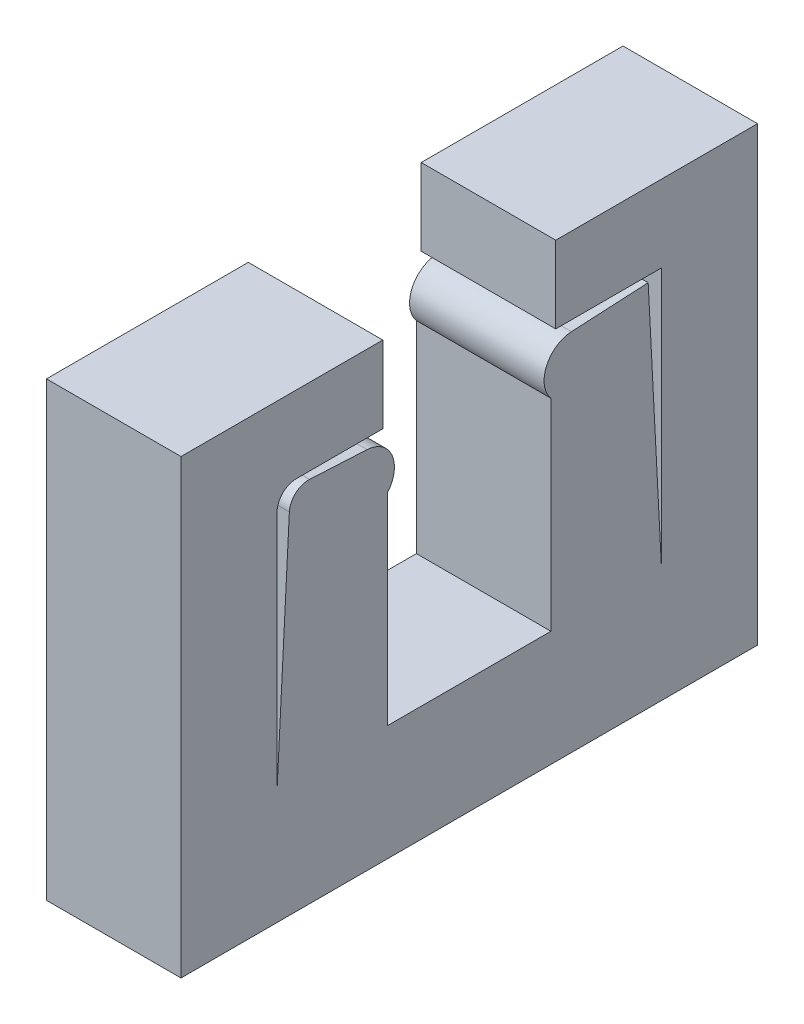
ISO-10303-21;
HEADER;
FILE_DESCRIPTION(('STEP AP214'),'2;1');
FILE_NAME('part.step','',(''),(''),'','','');
FILE_SCHEMA(('AUTOMOTIVE_DESIGN { 1 0 10303 214 1 1 1 1 }'));
ENDSEC;
DATA;
#1=APPLICATION_CONTEXT('core data for automotive mechanical design processes');
#2=APPLICATION_PROTOCOL_DEFINITION('international standard','automotive_design',2000,#1);
#3=PRODUCT_CONTEXT('',#1,'mechanical');
#4=PRODUCT('Part','Part','',(#3));
#5=PRODUCT_RELATED_PRODUCT_CATEGORY('part','',(#4));
#6=PRODUCT_DEFINITION_FORMATION('','',#4);
#7=PRODUCT_DEFINITION_CONTEXT('part definition',#1,'design');
#8=PRODUCT_DEFINITION('design','',#6,#7);
#9=PRODUCT_DEFINITION_SHAPE('','',#8);
#10=(LENGTH_UNIT() NAMED_UNIT(*) SI_UNIT(.MILLI.,.METRE.));
#11=(NAMED_UNIT(*) PLANE_ANGLE_UNIT() SI_UNIT($,.RADIAN.));
#12=(NAMED_UNIT(*) SI_UNIT($,.STERADIAN.) SOLID_ANGLE_UNIT());
#13=UNCERTAINTY_MEASURE_WITH_UNIT(LENGTH_MEASURE(1.E-05),#10,'distance_accuracy_value','');
#14=(GEOMETRIC_REPRESENTATION_CONTEXT(3) GLOBAL_UNCERTAINTY_ASSIGNED_CONTEXT((#13)) GLOBAL_UNIT_ASSIGNED_CONTEXT((#10,
#11,#12)) REPRESENTATION_CONTEXT('',''));
#15=CARTESIAN_POINT('',(0.,0.,0.));
#16=DIRECTION('',(0.,0.,1.));
#17=DIRECTION('',(1.,0.,0.));
#18=AXIS2_PLACEMENT_3D('',#15,#16,#17);
#19=CARTESIAN_POINT('',(7.,49.2713297407778,87.5368565318083));
#20=DIRECTION('',(0.,-1.,0.));
#21=DIRECTION('',(0.,0.,-1.));
#22=AXIS2_PLACEMENT_3D('',#19,#20,#21);
#23=PLANE('',#22);
#24=DIRECTION('',(0.,0.,1.));
#25=VECTOR('',#24,1.);
#26=CARTESIAN_POINT('',(0.,49.2713297407778,87.5368565318083));
#27=LINE('',#26,#25);
#28=CARTESIAN_POINT('',(0.,49.2713297407778,77.0368565318083));
#29=VERTEX_POINT('',#28);
#30=CARTESIAN_POINT('',(0.,49.2713297407778,87.5368565318083));
#31=VERTEX_POINT('',#30);
#32=EDGE_CURVE('E193',#29,#31,#27,.T.);
#33=ORIENTED_EDGE('',*,*,#32,.T.);
#34=DIRECTION('',(-1.,0.,0.));
#35=VECTOR('',#34,1.);
#36=CARTESIAN_POINT('',(7.,49.2713297407778,87.5368565318083));
#37=LINE('',#36,#35);
#38=CARTESIAN_POINT('',(7.,49.2713297407778,87.5368565318083));
#39=VERTEX_POINT('',#38);
#40=EDGE_CURVE('E337',#39,#31,#37,.T.);
#41=ORIENTED_EDGE('',*,*,#40,.F.);
#42=DIRECTION('',(0.,0.,1.));
#43=VECTOR('',#42,1.);
#44=CARTESIAN_POINT('',(7.,49.2713297407778,87.5368565318083));
#45=LINE('',#44,#43);
#46=CARTESIAN_POINT('',(7.,49.2713297407778,77.0368565318083));
#47=VERTEX_POINT('',#46);
#48=EDGE_CURVE('E270',#47,#39,#45,.T.);
#49=ORIENTED_EDGE('',*,*,#48,.F.);
#50=DIRECTION('',(-1.,0.,0.));
#51=VECTOR('',#50,1.);
#52=CARTESIAN_POINT('',(7.,49.2713297407778,77.0368565318083));
#53=LINE('',#52,#51);
#54=EDGE_CURVE('E294',#47,#29,#53,.T.);
#55=ORIENTED_EDGE('',*,*,#54,.T.);
#56=EDGE_LOOP('',(#33,#41,#49,#55));
#57=FACE_BOUND('',#56,.T.);
#58=ADVANCED_FACE('F33',(#57),#23,.F.);
#59=CARTESIAN_POINT('',(7.,49.2713297407778,87.5368565318083));
#60=DIRECTION('',(0.,0.,-1.));
#61=DIRECTION('',(-1.,0.,0.));
#62=AXIS2_PLACEMENT_3D('',#59,#60,#61);
#63=PLANE('',#62);
#64=DIRECTION('',(0.,-1.,0.));
#65=VECTOR('',#64,1.);
#66=CARTESIAN_POINT('',(0.,49.2713297407778,87.5368565318083));
#67=LINE('',#66,#65);
#68=CARTESIAN_POINT('',(0.,25.7713297407778,87.5368565318083));
#69=VERTEX_POINT('',#68);
#70=EDGE_CURVE('E297',#31,#69,#67,.T.);
#71=ORIENTED_EDGE('',*,*,#70,.T.);
#72=DIRECTION('',(-1.,0.,0.));
#73=VECTOR('',#72,1.);
#74=CARTESIAN_POINT('',(7.,25.7713297407778,87.5368565318083));
#75=LINE('',#74,#73);
#76=CARTESIAN_POINT('',(7.,25.7713297407778,87.5368565318083));
#77=VERTEX_POINT('',#76);
#78=EDGE_CURVE('E334',#77,#69,#75,.T.);
#79=ORIENTED_EDGE('',*,*,#78,.F.);
#80=DIRECTION('',(0.,-1.,0.));
#81=VECTOR('',#80,1.);
#82=CARTESIAN_POINT('',(7.,49.2713297407778,87.5368565318083));
#83=LINE('',#82,#81);
#84=EDGE_CURVE('E273',#39,#77,#83,.T.);
#85=ORIENTED_EDGE('',*,*,#84,.F.);
#86=ORIENTED_EDGE('',*,*,#40,.T.);
#87=EDGE_LOOP('',(#71,#79,#85,#86));
#88=FACE_BOUND('',#87,.T.);
#89=ADVANCED_FACE('F380',(#88),#63,.F.);
#90=CARTESIAN_POINT('',(7.,25.7713297407778,87.5368565318083));
#91=DIRECTION('',(0.,1.,0.));
#92=DIRECTION('',(0.,0.,1.));
#93=AXIS2_PLACEMENT_3D('',#90,#91,#92);
#94=PLANE('',#93);
#95=DIRECTION('',(0.,0.,-1.));
#96=VECTOR('',#95,1.);
#97=CARTESIAN_POINT('',(0.,25.7713297407778,87.5368565318083));
#98=LINE('',#97,#96);
#99=CARTESIAN_POINT('',(0.,25.7713297407778,57.5368565318083));
#100=VERTEX_POINT('',#99);
#101=EDGE_CURVE('E299',#69,#100,#98,.T.);
#102=ORIENTED_EDGE('',*,*,#101,.T.);
#103=DIRECTION('',(-1.,0.,0.));
#104=VECTOR('',#103,1.);
#105=CARTESIAN_POINT('',(7.,25.7713297407778,57.5368565318083));
#106=LINE('',#105,#104);
#107=CARTESIAN_POINT('',(7.,25.7713297407778,57.5368565318083));
#108=VERTEX_POINT('',#107);
#109=EDGE_CURVE('E253',#108,#100,#106,.T.);
#110=ORIENTED_EDGE('',*,*,#109,.F.);
#111=DIRECTION('',(0.,0.,-1.));
#112=VECTOR('',#111,1.);
#113=CARTESIAN_POINT('',(7.,25.7713297407778,87.5368565318083));
#114=LINE('',#113,#112);
#115=EDGE_CURVE('E276',#77,#108,#114,.T.);
#116=ORIENTED_EDGE('',*,*,#115,.F.);
#117=ORIENTED_EDGE('',*,*,#78,.T.);
#118=EDGE_LOOP('',(#102,#110,#116,#117));
#119=FACE_BOUND('',#118,.T.);
#120=ADVANCED_FACE('F385',(#119),#94,.F.);
#121=CARTESIAN_POINT('',(7.,31.7713297407778,76.7868565318083));
#122=DIRECTION('',(0.,-1.,0.));
#123=DIRECTION('',(0.,0.,-1.));
#124=AXIS2_PLACEMENT_3D('',#121,#122,#123);
#125=PLANE('',#124);
#126=DIRECTION('',(0.,0.,1.));
#127=VECTOR('',#126,1.);
#128=CARTESIAN_POINT('',(0.,31.7713297407778,76.7868565318083));
#129=LINE('',#128,#127);
#130=CARTESIAN_POINT('',(0.,31.7713297407778,68.2868565318083));
#131=VERTEX_POINT('',#130);
#132=CARTESIAN_POINT('',(0.,31.7713297407778,76.7868565318083));
#133=VERTEX_POINT('',#132);
#134=EDGE_CURVE('E301',#131,#133,#129,.T.);
#135=ORIENTED_EDGE('',*,*,#134,.T.);
#136=DIRECTION('',(-1.,0.,0.));
#137=VECTOR('',#136,1.);
#138=CARTESIAN_POINT('',(7.,31.7713297407778,76.7868565318083));
#139=LINE('',#138,#137);
#140=CARTESIAN_POINT('',(7.,31.7713297407778,76.7868565318083));
#141=VERTEX_POINT('',#140);
#142=EDGE_CURVE('E331',#141,#133,#139,.T.);
#143=ORIENTED_EDGE('',*,*,#142,.F.);
#144=DIRECTION('',(0.,0.,1.));
#145=VECTOR('',#144,1.);
#146=CARTESIAN_POINT('',(7.,31.7713297407778,76.7868565318083));
#147=LINE('',#146,#145);
#148=CARTESIAN_POINT('',(7.,31.7713297407778,68.2868565318083));
#149=VERTEX_POINT('',#148);
#150=EDGE_CURVE('E278',#149,#141,#147,.T.);
#151=ORIENTED_EDGE('',*,*,#150,.F.);
#152=DIRECTION('',(-1.,0.,0.));
#153=VECTOR('',#152,1.);
#154=CARTESIAN_POINT('',(7.,31.7713297407778,68.2868565318083));
#155=LINE('',#154,#153);
#156=EDGE_CURVE('E256',#149,#131,#155,.T.);
#157=ORIENTED_EDGE('',*,*,#156,.T.);
#158=EDGE_LOOP('',(#135,#143,#151,#157));
#159=FACE_BOUND('',#158,.T.);
#160=ADVANCED_FACE('F391',(#159),#125,.F.);
#161=CARTESIAN_POINT('',(7.,42.2713297407778,76.7868565318083));
#162=DIRECTION('',(0.,0.,1.));
#163=DIRECTION('',(0.,-1.,0.));
#164=AXIS2_PLACEMENT_3D('',#161,#162,#163);
#165=PLANE('',#164);
#166=DIRECTION('',(0.,1.,0.));
#167=VECTOR('',#166,1.);
#168=CARTESIAN_POINT('',(0.,42.2713297407778,76.7868565318083));
#169=LINE('',#168,#167);
#170=CARTESIAN_POINT('',(0.,42.2713297407778,76.7868565318083));
#171=VERTEX_POINT('',#170);
#172=EDGE_CURVE('E303',#133,#171,#169,.T.);
#173=ORIENTED_EDGE('',*,*,#172,.T.);
#174=DIRECTION('',(-1.,0.,0.));
#175=VECTOR('',#174,1.);
#176=CARTESIAN_POINT('',(7.,42.2713297407778,76.7868565318083));
#177=LINE('',#176,#175);
#178=CARTESIAN_POINT('',(7.,42.2713297407778,76.7868565318083));
#179=VERTEX_POINT('',#178);
#180=EDGE_CURVE('E328',#179,#171,#177,.T.);
#181=ORIENTED_EDGE('',*,*,#180,.F.);
#182=DIRECTION('',(0.,1.,0.));
#183=VECTOR('',#182,1.);
#184=CARTESIAN_POINT('',(7.,42.2713297407778,76.7868565318083));
#185=LINE('',#184,#183);
#186=EDGE_CURVE('E280',#141,#179,#185,.T.);
#187=ORIENTED_EDGE('',*,*,#186,.F.);
#188=ORIENTED_EDGE('',*,*,#142,.T.);
#189=EDGE_LOOP('',(#173,#181,#187,#188));
#190=FACE_BOUND('',#189,.T.);
#191=ADVANCED_FACE('F395',(#190),#165,.F.);
#192=CARTESIAN_POINT('',(7.,43.2422915456301,77.9301995133838));
#193=DIRECTION('',(-1.,0.,0.));
#194=DIRECTION('',(0.,0.,1.));
#195=AXIS2_PLACEMENT_3D('',#192,#193,#194);
#196=CYLINDRICAL_SURFACE('',#195,1.49999999999999);
#197=CARTESIAN_POINT('',(0.,43.2422915456301,77.9301995133838));
#198=DIRECTION('',(1.,0.,0.));
#199=DIRECTION('',(0.,0.,1.));
#200=AXIS2_PLACEMENT_3D('',#197,#198,#199);
#201=CIRCLE('',#200,1.49999999999999);
#202=CARTESIAN_POINT('',(0.,44.740235847762,77.8516955790194));
#203=VERTEX_POINT('',#202);
#204=EDGE_CURVE('E305',#171,#203,#201,.T.);
#205=ORIENTED_EDGE('',*,*,#204,.T.);
#206=DIRECTION('',(-1.,0.,0.));
#207=VECTOR('',#206,1.);
#208=CARTESIAN_POINT('',(7.,44.740235847762,77.8516955790194));
#209=LINE('',#208,#207);
#210=CARTESIAN_POINT('',(7.,44.740235847762,77.8516955790194));
#211=VERTEX_POINT('',#210);
#212=EDGE_CURVE('E325',#211,#203,#209,.T.);
#213=ORIENTED_EDGE('',*,*,#212,.F.);
#214=CARTESIAN_POINT('',(7.,43.2422915456301,77.9301995133838));
#215=DIRECTION('',(1.,0.,0.));
#216=DIRECTION('',(0.,0.,1.));
#217=AXIS2_PLACEMENT_3D('',#214,#215,#216);
#218=CIRCLE('',#217,1.49999999999999);
#219=EDGE_CURVE('E282',#179,#211,#218,.T.);
#220=ORIENTED_EDGE('',*,*,#219,.F.);
#221=ORIENTED_EDGE('',*,*,#180,.T.);
#222=EDGE_LOOP('',(#205,#213,#220,#221));
#223=FACE_BOUND('',#222,.T.);
#224=ADVANCED_FACE('F399',(#223),#196,.T.);
#225=CARTESIAN_POINT('',(7.,44.9495796727337,81.8462137180377));
#226=DIRECTION('',(0.,-0.998629534754574,0.0523359562429378));
#227=DIRECTION('',(0.,-0.0523359562429378,-0.998629534754574));
#228=AXIS2_PLACEMENT_3D('',#225,#226,#227);
#229=PLANE('',#228);
#230=DIRECTION('',(0.,0.0523359562429378,0.998629534754574));
#231=VECTOR('',#230,1.);
#232=CARTESIAN_POINT('',(0.,44.9495796727337,81.8462137180377));
#233=LINE('',#232,#231);
#234=CARTESIAN_POINT('',(0.,44.8972437164908,80.8475841832831));
#235=VERTEX_POINT('',#234);
#236=EDGE_CURVE('E307',#203,#235,#233,.T.);
#237=ORIENTED_EDGE('',*,*,#236,.T.);
#238=DIRECTION('',(-1.,0.,0.));
#239=VECTOR('',#238,1.);
#240=CARTESIAN_POINT('',(7.,44.8972437164908,80.8475841832831));
#241=LINE('',#240,#239);
#242=CARTESIAN_POINT('',(7.,44.8972437164908,80.8475841832831));
#243=VERTEX_POINT('',#242);
#244=EDGE_CURVE('E345',#235,#243,#241,.F.);
#245=ORIENTED_EDGE('',*,*,#244,.T.);
#246=DIRECTION('',(0.,0.0523359562429378,0.998629534754574));
#247=VECTOR('',#246,1.);
#248=CARTESIAN_POINT('',(7.,44.9495796727337,81.8462137180377));
#249=LINE('',#248,#247);
#250=EDGE_CURVE('E284',#211,#243,#249,.T.);
#251=ORIENTED_EDGE('',*,*,#250,.F.);
#252=ORIENTED_EDGE('',*,*,#212,.T.);
#253=EDGE_LOOP('',(#237,#245,#251,#252));
#254=FACE_BOUND('',#253,.T.);
#255=ADVANCED_FACE('F403',(#254),#229,.F.);
#256=CARTESIAN_POINT('',(7.,31.7713297407778,82.5368565318083));
#257=DIRECTION('',(0.,-0.0523359562429372,-0.998629534754574));
#258=DIRECTION('',(0.,0.998629534754574,-0.0523359562429372));
#259=AXIS2_PLACEMENT_3D('',#256,#257,#258);
#260=PLANE('',#259);
#261=DIRECTION('',(0.,-0.998629534754574,0.0523359562429372));
#262=VECTOR('',#261,1.);
#263=CARTESIAN_POINT('',(7.,31.7713297407778,82.5368565318083));
#264=LINE('',#263,#262);
#265=CARTESIAN_POINT('',(7.,43.9509501379791,81.8985496742806));
#266=VERTEX_POINT('',#265);
#267=CARTESIAN_POINT('',(7.,31.7713297407778,82.5368565318083));
#268=VERTEX_POINT('',#267);
#269=EDGE_CURVE('E286',#266,#268,#264,.T.);
#270=ORIENTED_EDGE('',*,*,#269,.F.);
#271=DIRECTION('',(-1.,0.,0.));
#272=VECTOR('',#271,1.);
#273=CARTESIAN_POINT('',(7.,43.9509501379791,81.8985496742806));
#274=LINE('',#273,#272);
#275=CARTESIAN_POINT('',(0.,43.9509501379791,81.8985496742806));
#276=VERTEX_POINT('',#275);
#277=EDGE_CURVE('E340',#266,#276,#274,.T.);
#278=ORIENTED_EDGE('',*,*,#277,.T.);
#279=DIRECTION('',(0.,-0.998629534754574,0.0523359562429372));
#280=VECTOR('',#279,1.);
#281=CARTESIAN_POINT('',(0.,31.7713297407778,82.5368565318083));
#282=LINE('',#281,#280);
#283=CARTESIAN_POINT('',(0.,31.7713297407778,82.5368565318083));
#284=VERTEX_POINT('',#283);
#285=EDGE_CURVE('E310',#276,#284,#282,.T.);
#286=ORIENTED_EDGE('',*,*,#285,.T.);
#287=DIRECTION('',(-1.,0.,0.));
#288=VECTOR('',#287,1.);
#289=CARTESIAN_POINT('',(7.,31.7713297407778,82.5368565318083));
#290=LINE('',#289,#288);
#291=EDGE_CURVE('E322',#268,#284,#290,.T.);
#292=ORIENTED_EDGE('',*,*,#291,.F.);
#293=EDGE_LOOP('',(#270,#278,#286,#292));
#294=FACE_BOUND('',#293,.T.);
#295=ADVANCED_FACE('F407',(#294),#260,.F.);
#296=CARTESIAN_POINT('',(7.,45.2713297407778,82.5368565318083));
#297=DIRECTION('',(0.,0.,1.));
#298=DIRECTION('',(1.,0.,0.));
#299=AXIS2_PLACEMENT_3D('',#296,#297,#298);
#300=PLANE('',#299);
#301=DIRECTION('',(0.,1.,0.));
#302=VECTOR('',#301,1.);
#303=CARTESIAN_POINT('',(0.,45.2713297407778,82.5368565318083));
#304=LINE('',#303,#302);
#305=CARTESIAN_POINT('',(0.,44.2713297407778,82.5368565318083));
#306=VERTEX_POINT('',#305);
#307=EDGE_CURVE('E312',#284,#306,#304,.T.);
#308=ORIENTED_EDGE('',*,*,#307,.T.);
#309=DIRECTION('',(-1.,0.,0.));
#310=VECTOR('',#309,1.);
#311=CARTESIAN_POINT('',(7.,44.2713297407778,82.5368565318083));
#312=LINE('',#311,#310);
#313=CARTESIAN_POINT('',(7.,44.2713297407778,82.5368565318083));
#314=VERTEX_POINT('',#313);
#315=EDGE_CURVE('E48',#306,#314,#312,.F.);
#316=ORIENTED_EDGE('',*,*,#315,.T.);
#317=DIRECTION('',(0.,1.,0.));
#318=VECTOR('',#317,1.);
#319=CARTESIAN_POINT('',(7.,45.2713297407778,82.5368565318083));
#320=LINE('',#319,#318);
#321=EDGE_CURVE('E288',#268,#314,#320,.T.);
#322=ORIENTED_EDGE('',*,*,#321,.F.);
#323=ORIENTED_EDGE('',*,*,#291,.T.);
#324=EDGE_LOOP('',(#308,#316,#322,#323));
#325=FACE_BOUND('',#324,.T.);
#326=ADVANCED_FACE('F411',(#325),#300,.F.);
#327=CARTESIAN_POINT('',(7.,45.2713297407778,82.5368565318083));
#328=DIRECTION('',(0.,1.,0.));
#329=DIRECTION('',(0.,0.,1.));
#330=AXIS2_PLACEMENT_3D('',#327,#328,#329);
#331=PLANE('',#330);
#332=DIRECTION('',(0.,0.,-1.));
#333=VECTOR('',#332,1.);
#334=CARTESIAN_POINT('',(7.,45.2713297407778,82.5368565318083));
#335=LINE('',#334,#333);
#336=CARTESIAN_POINT('',(7.,45.2713297407778,81.5368565318083));
#337=VERTEX_POINT('',#336);
#338=CARTESIAN_POINT('',(7.,45.2713297407778,77.0368565318083));
#339=VERTEX_POINT('',#338);
#340=EDGE_CURVE('E290',#337,#339,#335,.T.);
#341=ORIENTED_EDGE('',*,*,#340,.F.);
#342=DIRECTION('',(-1.,0.,0.));
#343=VECTOR('',#342,1.);
#344=CARTESIAN_POINT('',(0.,45.2713297407778,81.5368565318083));
#345=LINE('',#344,#343);
#346=CARTESIAN_POINT('',(0.,45.2713297407778,81.5368565318083));
#347=VERTEX_POINT('',#346);
#348=EDGE_CURVE('E349',#337,#347,#345,.T.);
#349=ORIENTED_EDGE('',*,*,#348,.T.);
#350=DIRECTION('',(0.,0.,-1.));
#351=VECTOR('',#350,1.);
#352=CARTESIAN_POINT('',(0.,45.2713297407778,82.5368565318083));
#353=LINE('',#352,#351);
#354=CARTESIAN_POINT('',(0.,45.2713297407778,77.0368565318083));
#355=VERTEX_POINT('',#354);
#356=EDGE_CURVE('E314',#347,#355,#353,.T.);
#357=ORIENTED_EDGE('',*,*,#356,.T.);
#358=DIRECTION('',(-1.,0.,0.));
#359=VECTOR('',#358,1.);
#360=CARTESIAN_POINT('',(7.,45.2713297407778,77.0368565318083));
#361=LINE('',#360,#359);
#362=EDGE_CURVE('E319',#339,#355,#361,.T.);
#363=ORIENTED_EDGE('',*,*,#362,.F.);
#364=EDGE_LOOP('',(#341,#349,#357,#363));
#365=FACE_BOUND('',#364,.T.);
#366=ADVANCED_FACE('F355',(#365),#331,.F.);
#367=CARTESIAN_POINT('',(7.,45.2713297407778,77.0368565318083));
#368=DIRECTION('',(0.,0.,1.));
#369=DIRECTION('',(1.,0.,0.));
#370=AXIS2_PLACEMENT_3D('',#367,#368,#369);
#371=PLANE('',#370);
#372=DIRECTION('',(0.,1.,0.));
#373=VECTOR('',#372,1.);
#374=CARTESIAN_POINT('',(0.,45.2713297407778,77.0368565318083));
#375=LINE('',#374,#373);
#376=EDGE_CURVE('E274',#355,#29,#375,.T.);
#377=ORIENTED_EDGE('',*,*,#376,.T.);
#378=ORIENTED_EDGE('',*,*,#54,.F.);
#379=DIRECTION('',(0.,1.,0.));
#380=VECTOR('',#379,1.);
#381=CARTESIAN_POINT('',(7.,45.2713297407778,77.0368565318083));
#382=LINE('',#381,#380);
#383=EDGE_CURVE('E292',#339,#47,#382,.T.);
#384=ORIENTED_EDGE('',*,*,#383,.F.);
#385=ORIENTED_EDGE('',*,*,#362,.T.);
#386=EDGE_LOOP('',(#377,#378,#384,#385));
#387=FACE_BOUND('',#386,.T.);
#388=ADVANCED_FACE('F365',(#387),#371,.F.);
#389=CARTESIAN_POINT('',(7.,43.2422915456301,77.9301995133838));
#390=DIRECTION('',(-1.,0.,0.));
#391=DIRECTION('',(0.,0.,1.));
#392=AXIS2_PLACEMENT_3D('',#389,#390,#391);
#393=PLANE('',#392);
#394=ORIENTED_EDGE('',*,*,#250,.T.);
#395=CARTESIAN_POINT('',(7.,43.8986141817362,80.8999201395261));
#396=DIRECTION('',(-1.,0.,0.));
#397=DIRECTION('',(0.,0.,1.));
#398=AXIS2_PLACEMENT_3D('',#395,#396,#397);
#399=CIRCLE('',#398,1.);
#400=EDGE_CURVE('E347',#243,#266,#399,.F.);
#401=ORIENTED_EDGE('',*,*,#400,.T.);
#402=ORIENTED_EDGE('',*,*,#269,.T.);
#403=ORIENTED_EDGE('',*,*,#321,.T.);
#404=CARTESIAN_POINT('',(7.,44.2713297407778,81.5368565318083));
#405=DIRECTION('',(-1.,0.,0.));
#406=DIRECTION('',(0.,0.,1.));
#407=AXIS2_PLACEMENT_3D('',#404,#405,#406);
#408=CIRCLE('',#407,1.);
#409=EDGE_CURVE('E11',#314,#337,#408,.T.);
#410=ORIENTED_EDGE('',*,*,#409,.T.);
#411=ORIENTED_EDGE('',*,*,#340,.T.);
#412=ORIENTED_EDGE('',*,*,#383,.T.);
#413=ORIENTED_EDGE('',*,*,#48,.T.);
#414=ORIENTED_EDGE('',*,*,#84,.T.);
#415=ORIENTED_EDGE('',*,*,#115,.T.);
#416=DIRECTION('',(0.,-1.,0.));
#417=VECTOR('',#416,1.);
#418=CARTESIAN_POINT('',(7.,49.2713297407778,57.5368565318083));
#419=LINE('',#418,#417);
#420=CARTESIAN_POINT('',(7.,49.2713297407778,57.5368565318083));
#421=VERTEX_POINT('',#420);
#422=EDGE_CURVE('E204',#421,#108,#419,.T.);
#423=ORIENTED_EDGE('',*,*,#422,.F.);
#424=DIRECTION('',(0.,0.,-1.));
#425=VECTOR('',#424,1.);
#426=CARTESIAN_POINT('',(7.,49.2713297407778,57.5368565318083));
#427=LINE('',#426,#425);
#428=CARTESIAN_POINT('',(7.,49.2713297407778,68.0368565318083));
#429=VERTEX_POINT('',#428);
#430=EDGE_CURVE('E185',#429,#421,#427,.T.);
#431=ORIENTED_EDGE('',*,*,#430,.F.);
#432=DIRECTION('',(0.,1.,0.));
#433=VECTOR('',#432,1.);
#434=CARTESIAN_POINT('',(7.,45.2713297407778,68.0368565318083));
#435=LINE('',#434,#433);
#436=CARTESIAN_POINT('',(7.,45.2713297407778,68.0368565318083));
#437=VERTEX_POINT('',#436);
#438=EDGE_CURVE('E201',#437,#429,#435,.T.);
#439=ORIENTED_EDGE('',*,*,#438,.F.);
#440=DIRECTION('',(0.,0.,1.));
#441=VECTOR('',#440,1.);
#442=CARTESIAN_POINT('',(7.,45.2713297407778,62.5368565318083));
#443=LINE('',#442,#441);
#444=CARTESIAN_POINT('',(7.,45.2713297407778,62.5368565318083));
#445=VERTEX_POINT('',#444);
#446=EDGE_CURVE('E208',#445,#437,#443,.T.);
#447=ORIENTED_EDGE('',*,*,#446,.F.);
#448=DIRECTION('',(0.,1.,0.));
#449=VECTOR('',#448,1.);
#450=CARTESIAN_POINT('',(7.,45.2713297407778,62.5368565318083));
#451=LINE('',#450,#449);
#452=CARTESIAN_POINT('',(7.,31.7713297407778,62.5368565318083));
#453=VERTEX_POINT('',#452);
#454=EDGE_CURVE('E210',#453,#445,#451,.T.);
#455=ORIENTED_EDGE('',*,*,#454,.F.);
#456=DIRECTION('',(0.,-0.998629534754574,-0.0523359562429372));
#457=VECTOR('',#456,1.);
#458=CARTESIAN_POINT('',(7.,31.7713297407778,62.5368565318083));
#459=LINE('',#458,#457);
#460=CARTESIAN_POINT('',(7.,44.9495796727337,63.2274993455789));
#461=VERTEX_POINT('',#460);
#462=EDGE_CURVE('E215',#461,#453,#459,.T.);
#463=ORIENTED_EDGE('',*,*,#462,.F.);
#464=DIRECTION('',(0.,0.0523359562429378,-0.998629534754574));
#465=VECTOR('',#464,1.);
#466=CARTESIAN_POINT('',(7.,44.9495796727337,63.2274993455789));
#467=LINE('',#466,#465);
#468=CARTESIAN_POINT('',(7.,44.740235847762,67.2220174845972));
#469=VERTEX_POINT('',#468);
#470=EDGE_CURVE('E218',#469,#461,#467,.T.);
#471=ORIENTED_EDGE('',*,*,#470,.F.);
#472=CARTESIAN_POINT('',(7.,43.2422915456301,67.1435135502328));
#473=DIRECTION('',(-1.,0.,0.));
#474=DIRECTION('',(0.,0.,-1.));
#475=AXIS2_PLACEMENT_3D('',#472,#473,#474);
#476=CIRCLE('',#475,1.49999999999999);
#477=CARTESIAN_POINT('',(7.,42.2713297407778,68.2868565318083));
#478=VERTEX_POINT('',#477);
#479=EDGE_CURVE('E221',#478,#469,#476,.T.);
#480=ORIENTED_EDGE('',*,*,#479,.F.);
#481=DIRECTION('',(0.,1.,0.));
#482=VECTOR('',#481,1.);
#483=CARTESIAN_POINT('',(7.,42.2713297407778,68.2868565318083));
#484=LINE('',#483,#482);
#485=EDGE_CURVE('E224',#149,#478,#484,.T.);
#486=ORIENTED_EDGE('',*,*,#485,.F.);
#487=ORIENTED_EDGE('',*,*,#150,.T.);
#488=ORIENTED_EDGE('',*,*,#186,.T.);
#489=ORIENTED_EDGE('',*,*,#219,.T.);
#490=EDGE_LOOP('',(#394,#401,#402,#403,#410,#411,#412,#413,#414,#415,#423,#431,#439,#447,#455,
#463,#471,#480,#486,#487,#488,#489));
#491=FACE_BOUND('',#490,.T.);
#492=ADVANCED_FACE('F199',(#491),#393,.F.);
#493=CARTESIAN_POINT('',(0.,43.2422915456301,77.9301995133838));
#494=DIRECTION('',(-1.,0.,0.));
#495=DIRECTION('',(0.,0.,1.));
#496=AXIS2_PLACEMENT_3D('',#493,#494,#495);
#497=PLANE('',#496);
#498=ORIENTED_EDGE('',*,*,#285,.F.);
#499=CARTESIAN_POINT('',(0.,43.8986141817362,80.8999201395261));
#500=DIRECTION('',(-1.,0.,0.));
#501=DIRECTION('',(0.,0.,1.));
#502=AXIS2_PLACEMENT_3D('',#499,#500,#501);
#503=CIRCLE('',#502,1.);
#504=EDGE_CURVE('E343',#276,#235,#503,.T.);
#505=ORIENTED_EDGE('',*,*,#504,.T.);
#506=ORIENTED_EDGE('',*,*,#236,.F.);
#507=ORIENTED_EDGE('',*,*,#204,.F.);
#508=ORIENTED_EDGE('',*,*,#172,.F.);
#509=ORIENTED_EDGE('',*,*,#134,.F.);
#510=DIRECTION('',(0.,1.,0.));
#511=VECTOR('',#510,1.);
#512=CARTESIAN_POINT('',(0.,42.2713297407778,68.2868565318083));
#513=LINE('',#512,#511);
#514=CARTESIAN_POINT('',(0.,42.2713297407778,68.2868565318083));
#515=VERTEX_POINT('',#514);
#516=EDGE_CURVE('E247',#131,#515,#513,.T.);
#517=ORIENTED_EDGE('',*,*,#516,.T.);
#518=CARTESIAN_POINT('',(0.,43.2422915456301,67.1435135502328));
#519=DIRECTION('',(-1.,0.,0.));
#520=DIRECTION('',(0.,0.,-1.));
#521=AXIS2_PLACEMENT_3D('',#518,#519,#520);
#522=CIRCLE('',#521,1.49999999999999);
#523=CARTESIAN_POINT('',(0.,44.740235847762,67.2220174845972));
#524=VERTEX_POINT('',#523);
#525=EDGE_CURVE('E244',#515,#524,#522,.T.);
#526=ORIENTED_EDGE('',*,*,#525,.T.);
#527=DIRECTION('',(0.,0.0523359562429378,-0.998629534754574));
#528=VECTOR('',#527,1.);
#529=CARTESIAN_POINT('',(0.,44.9495796727337,63.2274993455789));
#530=LINE('',#529,#528);
#531=CARTESIAN_POINT('',(0.,44.9495796727337,63.2274993455789));
#532=VERTEX_POINT('',#531);
#533=EDGE_CURVE('E241',#524,#532,#530,.T.);
#534=ORIENTED_EDGE('',*,*,#533,.T.);
#535=DIRECTION('',(0.,-0.998629534754574,-0.0523359562429372));
#536=VECTOR('',#535,1.);
#537=CARTESIAN_POINT('',(0.,31.7713297407778,62.5368565318083));
#538=LINE('',#537,#536);
#539=CARTESIAN_POINT('',(0.,31.7713297407778,62.5368565318083));
#540=VERTEX_POINT('',#539);
#541=EDGE_CURVE('E238',#532,#540,#538,.T.);
#542=ORIENTED_EDGE('',*,*,#541,.T.);
#543=DIRECTION('',(0.,1.,0.));
#544=VECTOR('',#543,1.);
#545=CARTESIAN_POINT('',(0.,45.2713297407778,62.5368565318083));
#546=LINE('',#545,#544);
#547=CARTESIAN_POINT('',(0.,45.2713297407778,62.5368565318083));
#548=VERTEX_POINT('',#547);
#549=EDGE_CURVE('E235',#540,#548,#546,.T.);
#550=ORIENTED_EDGE('',*,*,#549,.T.);
#551=DIRECTION('',(0.,0.,1.));
#552=VECTOR('',#551,1.);
#553=CARTESIAN_POINT('',(0.,45.2713297407778,62.5368565318083));
#554=LINE('',#553,#552);
#555=CARTESIAN_POINT('',(0.,45.2713297407778,68.0368565318083));
#556=VERTEX_POINT('',#555);
#557=EDGE_CURVE('E232',#548,#556,#554,.T.);
#558=ORIENTED_EDGE('',*,*,#557,.T.);
#559=DIRECTION('',(0.,1.,0.));
#560=VECTOR('',#559,1.);
#561=CARTESIAN_POINT('',(0.,45.2713297407778,68.0368565318083));
#562=LINE('',#561,#560);
#563=CARTESIAN_POINT('',(0.,49.2713297407778,68.0368565318083));
#564=VERTEX_POINT('',#563);
#565=EDGE_CURVE('E230',#556,#564,#562,.T.);
#566=ORIENTED_EDGE('',*,*,#565,.T.);
#567=DIRECTION('',(0.,0.,-1.));
#568=VECTOR('',#567,1.);
#569=CARTESIAN_POINT('',(0.,49.2713297407778,57.5368565318083));
#570=LINE('',#569,#568);
#571=CARTESIAN_POINT('',(0.,49.2713297407778,57.5368565318083));
#572=VERTEX_POINT('',#571);
#573=EDGE_CURVE('E188',#564,#572,#570,.T.);
#574=ORIENTED_EDGE('',*,*,#573,.T.);
#575=DIRECTION('',(0.,-1.,0.));
#576=VECTOR('',#575,1.);
#577=CARTESIAN_POINT('',(0.,49.2713297407778,57.5368565318083));
#578=LINE('',#577,#576);
#579=EDGE_CURVE('E205',#572,#100,#578,.T.);
#580=ORIENTED_EDGE('',*,*,#579,.T.);
#581=ORIENTED_EDGE('',*,*,#101,.F.);
#582=ORIENTED_EDGE('',*,*,#70,.F.);
#583=ORIENTED_EDGE('',*,*,#32,.F.);
#584=ORIENTED_EDGE('',*,*,#376,.F.);
#585=ORIENTED_EDGE('',*,*,#356,.F.);
#586=CARTESIAN_POINT('',(0.,44.2713297407778,81.5368565318083));
#587=DIRECTION('',(-1.,0.,0.));
#588=DIRECTION('',(0.,0.,1.));
#589=AXIS2_PLACEMENT_3D('',#586,#587,#588);
#590=CIRCLE('',#589,1.);
#591=EDGE_CURVE('E41',#347,#306,#590,.F.);
#592=ORIENTED_EDGE('',*,*,#591,.T.);
#593=ORIENTED_EDGE('',*,*,#307,.F.);
#594=EDGE_LOOP('',(#498,#505,#506,#507,#508,#509,#517,#526,#534,#542,#550,#558,#566,#574,#580,
#581,#582,#583,#584,#585,#592,#593));
#595=FACE_BOUND('',#594,.T.);
#596=ADVANCED_FACE('F361',(#595),#497,.T.);
#597=CARTESIAN_POINT('',(7.,43.8986141817362,80.8999201395261));
#598=DIRECTION('',(-1.,0.,0.));
#599=DIRECTION('',(0.,0.,1.));
#600=AXIS2_PLACEMENT_3D('',#597,#598,#599);
#601=CYLINDRICAL_SURFACE('',#600,1.);
#602=ORIENTED_EDGE('',*,*,#400,.F.);
#603=ORIENTED_EDGE('',*,*,#244,.F.);
#604=ORIENTED_EDGE('',*,*,#504,.F.);
#605=ORIENTED_EDGE('',*,*,#277,.F.);
#606=EDGE_LOOP('',(#602,#603,#604,#605));
#607=FACE_BOUND('',#606,.T.);
#608=ADVANCED_FACE('F372',(#607),#601,.T.);
#609=CARTESIAN_POINT('',(7.,44.2713297407778,81.5368565318083));
#610=DIRECTION('',(1.,0.,0.));
#611=DIRECTION('',(0.,0.,-1.));
#612=AXIS2_PLACEMENT_3D('',#609,#610,#611);
#613=CYLINDRICAL_SURFACE('',#612,1.);
#614=ORIENTED_EDGE('',*,*,#409,.F.);
#615=ORIENTED_EDGE('',*,*,#315,.F.);
#616=ORIENTED_EDGE('',*,*,#591,.F.);
#617=ORIENTED_EDGE('',*,*,#348,.F.);
#618=EDGE_LOOP('',(#614,#615,#616,#617));
#619=FACE_BOUND('',#618,.T.);
#620=ADVANCED_FACE('F35',(#619),#613,.F.);
#621=CARTESIAN_POINT('',(7.,49.2713297407778,57.5368565318083));
#622=DIRECTION('',(0.,1.,0.));
#623=DIRECTION('',(0.,0.,1.));
#624=AXIS2_PLACEMENT_3D('',#621,#622,#623);
#625=PLANE('',#624);
#626=ORIENTED_EDGE('',*,*,#573,.F.);
#627=DIRECTION('',(-1.,0.,0.));
#628=VECTOR('',#627,1.);
#629=CARTESIAN_POINT('',(7.,49.2713297407778,68.0368565318083));
#630=LINE('',#629,#628);
#631=EDGE_CURVE('E182',#429,#564,#630,.T.);
#632=ORIENTED_EDGE('',*,*,#631,.F.);
#633=ORIENTED_EDGE('',*,*,#430,.T.);
#634=DIRECTION('',(-1.,0.,0.));
#635=VECTOR('',#634,1.);
#636=CARTESIAN_POINT('',(7.,49.2713297407778,57.5368565318083));
#637=LINE('',#636,#635);
#638=EDGE_CURVE('E228',#421,#572,#637,.T.);
#639=ORIENTED_EDGE('',*,*,#638,.T.);
#640=EDGE_LOOP('',(#626,#632,#633,#639));
#641=FACE_BOUND('',#640,.T.);
#642=ADVANCED_FACE('F184',(#641),#625,.T.);
#643=CARTESIAN_POINT('',(7.,45.2713297407778,68.0368565318083));
#644=DIRECTION('',(0.,0.,1.));
#645=DIRECTION('',(1.,0.,0.));
#646=AXIS2_PLACEMENT_3D('',#643,#644,#645);
#647=PLANE('',#646);
#648=ORIENTED_EDGE('',*,*,#565,.F.);
#649=DIRECTION('',(-1.,0.,0.));
#650=VECTOR('',#649,1.);
#651=CARTESIAN_POINT('',(7.,45.2713297407778,68.0368565318083));
#652=LINE('',#651,#650);
#653=EDGE_CURVE('E194',#437,#556,#652,.T.);
#654=ORIENTED_EDGE('',*,*,#653,.F.);
#655=ORIENTED_EDGE('',*,*,#438,.T.);
#656=ORIENTED_EDGE('',*,*,#631,.T.);
#657=EDGE_LOOP('',(#648,#654,#655,#656));
#658=FACE_BOUND('',#657,.T.);
#659=ADVANCED_FACE('F207',(#658),#647,.T.);
#660=CARTESIAN_POINT('',(7.,45.2713297407778,62.5368565318083));
#661=DIRECTION('',(0.,-1.,0.));
#662=DIRECTION('',(0.,0.,-1.));
#663=AXIS2_PLACEMENT_3D('',#660,#661,#662);
#664=PLANE('',#663);
#665=ORIENTED_EDGE('',*,*,#557,.F.);
#666=DIRECTION('',(-1.,0.,0.));
#667=VECTOR('',#666,1.);
#668=CARTESIAN_POINT('',(7.,45.2713297407778,62.5368565318083));
#669=LINE('',#668,#667);
#670=EDGE_CURVE('E267',#445,#548,#669,.T.);
#671=ORIENTED_EDGE('',*,*,#670,.F.);
#672=ORIENTED_EDGE('',*,*,#446,.T.);
#673=ORIENTED_EDGE('',*,*,#653,.T.);
#674=EDGE_LOOP('',(#665,#671,#672,#673));
#675=FACE_BOUND('',#674,.T.);
#676=ADVANCED_FACE('F425',(#675),#664,.T.);
#677=CARTESIAN_POINT('',(7.,45.2713297407778,62.5368565318083));
#678=DIRECTION('',(0.,0.,1.));
#679=DIRECTION('',(1.,0.,0.));
#680=AXIS2_PLACEMENT_3D('',#677,#678,#679);
#681=PLANE('',#680);
#682=ORIENTED_EDGE('',*,*,#549,.F.);
#683=DIRECTION('',(-1.,0.,0.));
#684=VECTOR('',#683,1.);
#685=CARTESIAN_POINT('',(7.,31.7713297407778,62.5368565318083));
#686=LINE('',#685,#684);
#687=EDGE_CURVE('E265',#453,#540,#686,.T.);
#688=ORIENTED_EDGE('',*,*,#687,.F.);
#689=ORIENTED_EDGE('',*,*,#454,.T.);
#690=ORIENTED_EDGE('',*,*,#670,.T.);
#691=EDGE_LOOP('',(#682,#688,#689,#690));
#692=FACE_BOUND('',#691,.T.);
#693=ADVANCED_FACE('F428',(#692),#681,.T.);
#694=CARTESIAN_POINT('',(7.,31.7713297407778,62.5368565318083));
#695=DIRECTION('',(0.,0.0523359562429372,-0.998629534754574));
#696=DIRECTION('',(0.,0.998629534754574,0.0523359562429372));
#697=AXIS2_PLACEMENT_3D('',#694,#695,#696);
#698=PLANE('',#697);
#699=ORIENTED_EDGE('',*,*,#541,.F.);
#700=DIRECTION('',(-1.,0.,0.));
#701=VECTOR('',#700,1.);
#702=CARTESIAN_POINT('',(7.,44.9495796727337,63.2274993455789));
#703=LINE('',#702,#701);
#704=EDGE_CURVE('E263',#461,#532,#703,.T.);
#705=ORIENTED_EDGE('',*,*,#704,.F.);
#706=ORIENTED_EDGE('',*,*,#462,.T.);
#707=ORIENTED_EDGE('',*,*,#687,.T.);
#708=EDGE_LOOP('',(#699,#705,#706,#707));
#709=FACE_BOUND('',#708,.T.);
#710=ADVANCED_FACE('F432',(#709),#698,.T.);
#711=CARTESIAN_POINT('',(7.,44.9495796727337,63.2274993455789));
#712=DIRECTION('',(0.,0.998629534754574,0.0523359562429378));
#713=DIRECTION('',(0.,-0.0523359562429378,0.998629534754574));
#714=AXIS2_PLACEMENT_3D('',#711,#712,#713);
#715=PLANE('',#714);
#716=ORIENTED_EDGE('',*,*,#533,.F.);
#717=DIRECTION('',(-1.,0.,0.));
#718=VECTOR('',#717,1.);
#719=CARTESIAN_POINT('',(7.,44.740235847762,67.2220174845972));
#720=LINE('',#719,#718);
#721=EDGE_CURVE('E261',#469,#524,#720,.T.);
#722=ORIENTED_EDGE('',*,*,#721,.F.);
#723=ORIENTED_EDGE('',*,*,#470,.T.);
#724=ORIENTED_EDGE('',*,*,#704,.T.);
#725=EDGE_LOOP('',(#716,#722,#723,#724));
#726=FACE_BOUND('',#725,.T.);
#727=ADVANCED_FACE('F436',(#726),#715,.T.);
#728=CARTESIAN_POINT('',(7.,43.2422915456301,67.1435135502328));
#729=DIRECTION('',(-1.,0.,0.));
#730=DIRECTION('',(0.,0.,1.));
#731=AXIS2_PLACEMENT_3D('',#728,#729,#730);
#732=CYLINDRICAL_SURFACE('',#731,1.49999999999999);
#733=ORIENTED_EDGE('',*,*,#525,.F.);
#734=DIRECTION('',(-1.,0.,0.));
#735=VECTOR('',#734,1.);
#736=CARTESIAN_POINT('',(7.,42.2713297407778,68.2868565318083));
#737=LINE('',#736,#735);
#738=EDGE_CURVE('E259',#478,#515,#737,.T.);
#739=ORIENTED_EDGE('',*,*,#738,.F.);
#740=ORIENTED_EDGE('',*,*,#479,.T.);
#741=ORIENTED_EDGE('',*,*,#721,.T.);
#742=EDGE_LOOP('',(#733,#739,#740,#741));
#743=FACE_BOUND('',#742,.T.);
#744=ADVANCED_FACE('F440',(#743),#732,.T.);
#745=CARTESIAN_POINT('',(7.,42.2713297407778,68.2868565318083));
#746=DIRECTION('',(0.,0.,1.));
#747=DIRECTION('',(0.,-1.,0.));
#748=AXIS2_PLACEMENT_3D('',#745,#746,#747);
#749=PLANE('',#748);
#750=ORIENTED_EDGE('',*,*,#516,.F.);
#751=ORIENTED_EDGE('',*,*,#156,.F.);
#752=ORIENTED_EDGE('',*,*,#485,.T.);
#753=ORIENTED_EDGE('',*,*,#738,.T.);
#754=EDGE_LOOP('',(#750,#751,#752,#753));
#755=FACE_BOUND('',#754,.T.);
#756=ADVANCED_FACE('F444',(#755),#749,.T.);
#757=CARTESIAN_POINT('',(7.,49.2713297407778,57.5368565318083));
#758=DIRECTION('',(0.,0.,-1.));
#759=DIRECTION('',(-1.,0.,0.));
#760=AXIS2_PLACEMENT_3D('',#757,#758,#759);
#761=PLANE('',#760);
#762=ORIENTED_EDGE('',*,*,#579,.F.);
#763=ORIENTED_EDGE('',*,*,#638,.F.);
#764=ORIENTED_EDGE('',*,*,#422,.T.);
#765=ORIENTED_EDGE('',*,*,#109,.T.);
#766=EDGE_LOOP('',(#762,#763,#764,#765));
#767=FACE_BOUND('',#766,.T.);
#768=ADVANCED_FACE('F448',(#767),#761,.T.);
#769=CLOSED_SHELL('',(#58,#89,#120,#160,#191,#224,#255,#295,#326,#366,#388,#492,#596,#608,#620,
#642,#659,#676,#693,#710,#727,#744,#756,#768));
#770=MANIFOLD_SOLID_BREP('B2',#769);
#771=ADVANCED_BREP_SHAPE_REPRESENTATION('',(#18,#770),#14);
#772=SHAPE_DEFINITION_REPRESENTATION(#9,#771);
ENDSEC;
END-ISO-10303-21;
